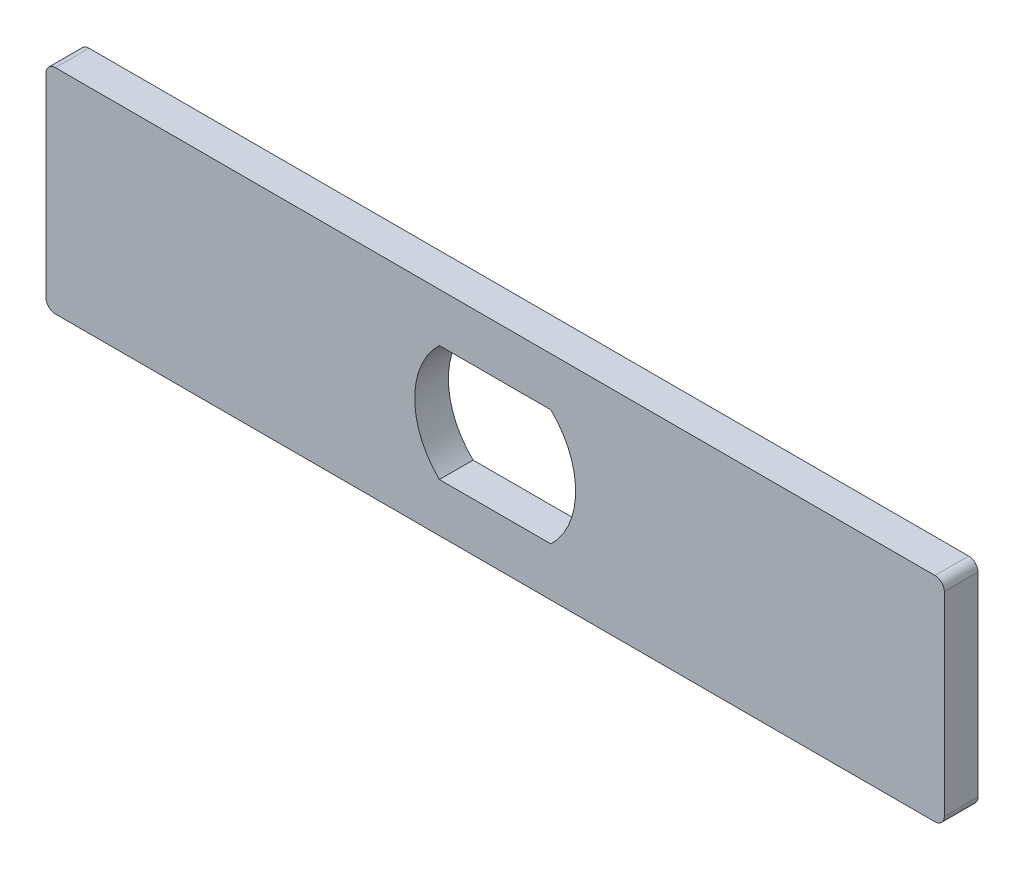
ISO-10303-21;
HEADER;
FILE_DESCRIPTION(('STEP AP214'),'2;1');
FILE_NAME('part.step','',(''),(''),'','','');
FILE_SCHEMA(('AUTOMOTIVE_DESIGN { 1 0 10303 214 1 1 1 1 }'));
ENDSEC;
DATA;
#1=APPLICATION_CONTEXT('core data for automotive mechanical design processes');
#2=APPLICATION_PROTOCOL_DEFINITION('international standard','automotive_design',2000,#1);
#3=PRODUCT_CONTEXT('',#1,'mechanical');
#4=PRODUCT('Part','Part','',(#3));
#5=PRODUCT_RELATED_PRODUCT_CATEGORY('part','',(#4));
#6=PRODUCT_DEFINITION_FORMATION('','',#4);
#7=PRODUCT_DEFINITION_CONTEXT('part definition',#1,'design');
#8=PRODUCT_DEFINITION('design','',#6,#7);
#9=PRODUCT_DEFINITION_SHAPE('','',#8);
#10=(LENGTH_UNIT() NAMED_UNIT(*) SI_UNIT(.MILLI.,.METRE.));
#11=(NAMED_UNIT(*) PLANE_ANGLE_UNIT() SI_UNIT($,.RADIAN.));
#12=(NAMED_UNIT(*) SI_UNIT($,.STERADIAN.) SOLID_ANGLE_UNIT());
#13=UNCERTAINTY_MEASURE_WITH_UNIT(LENGTH_MEASURE(1.E-05),#10,'distance_accuracy_value','');
#14=(GEOMETRIC_REPRESENTATION_CONTEXT(3) GLOBAL_UNCERTAINTY_ASSIGNED_CONTEXT((#13)) GLOBAL_UNIT_ASSIGNED_CONTEXT((#10,
#11,#12)) REPRESENTATION_CONTEXT('',''));
#15=CARTESIAN_POINT('',(0.,0.,0.));
#16=DIRECTION('',(0.,0.,1.));
#17=DIRECTION('',(1.,0.,0.));
#18=AXIS2_PLACEMENT_3D('',#15,#16,#17);
#19=CARTESIAN_POINT('',(60.9011411210408,0.,4.572));
#20=DIRECTION('',(1.,0.,0.));
#21=DIRECTION('',(0.,0.,-1.));
#22=AXIS2_PLACEMENT_3D('',#19,#20,#21);
#23=PLANE('',#22);
#24=DIRECTION('',(0.,-1.,0.));
#25=VECTOR('',#24,1.);
#26=CARTESIAN_POINT('',(60.9011411210408,0.,0.));
#27=LINE('',#26,#25);
#28=CARTESIAN_POINT('',(60.9011411210408,13.2621381013498,0.));
#29=VERTEX_POINT('',#28);
#30=CARTESIAN_POINT('',(60.9011411210408,-13.1538618986502,0.));
#31=VERTEX_POINT('',#30);
#32=EDGE_CURVE('E195',#29,#31,#27,.T.);
#33=ORIENTED_EDGE('',*,*,#32,.F.);
#34=DIRECTION('',(0.,0.,-1.));
#35=VECTOR('',#34,1.);
#36=CARTESIAN_POINT('',(60.9011411210408,13.2621381013498,4.572));
#37=LINE('',#36,#35);
#38=CARTESIAN_POINT('',(60.9011411210408,13.2621381013498,4.572));
#39=VERTEX_POINT('',#38);
#40=EDGE_CURVE('E50',#29,#39,#37,.F.);
#41=ORIENTED_EDGE('',*,*,#40,.T.);
#42=DIRECTION('',(0.,-1.,0.));
#43=VECTOR('',#42,1.);
#44=CARTESIAN_POINT('',(60.9011411210408,0.,4.572));
#45=LINE('',#44,#43);
#46=CARTESIAN_POINT('',(60.9011411210408,-13.1538618986502,4.572));
#47=VERTEX_POINT('',#46);
#48=EDGE_CURVE('E168',#39,#47,#45,.T.);
#49=ORIENTED_EDGE('',*,*,#48,.T.);
#50=DIRECTION('',(0.,0.,-1.));
#51=VECTOR('',#50,1.);
#52=CARTESIAN_POINT('',(60.9011411210408,-13.1538618986502,4.572));
#53=LINE('',#52,#51);
#54=EDGE_CURVE('E237',#47,#31,#53,.T.);
#55=ORIENTED_EDGE('',*,*,#54,.T.);
#56=EDGE_LOOP('',(#33,#41,#49,#55));
#57=FACE_BOUND('',#56,.T.);
#58=ADVANCED_FACE('F41',(#57),#23,.T.);
#59=CARTESIAN_POINT('',(0.,14.5321381013498,4.572));
#60=DIRECTION('',(0.,1.,0.));
#61=DIRECTION('',(0.,0.,1.));
#62=AXIS2_PLACEMENT_3D('',#59,#60,#61);
#63=PLANE('',#62);
#64=DIRECTION('',(1.,0.,0.));
#65=VECTOR('',#64,1.);
#66=CARTESIAN_POINT('',(0.,14.5321381013498,4.572));
#67=LINE('',#66,#65);
#68=CARTESIAN_POINT('',(-59.7488588789592,14.5321381013498,4.572));
#69=VERTEX_POINT('',#68);
#70=CARTESIAN_POINT('',(59.6311411210408,14.5321381013498,4.572));
#71=VERTEX_POINT('',#70);
#72=EDGE_CURVE('E171',#69,#71,#67,.T.);
#73=ORIENTED_EDGE('',*,*,#72,.T.);
#74=DIRECTION('',(0.,0.,-1.));
#75=VECTOR('',#74,1.);
#76=CARTESIAN_POINT('',(59.6311411210408,14.5321381013498,4.572));
#77=LINE('',#76,#75);
#78=CARTESIAN_POINT('',(59.6311411210408,14.5321381013498,0.));
#79=VERTEX_POINT('',#78);
#80=EDGE_CURVE('E251',#71,#79,#77,.T.);
#81=ORIENTED_EDGE('',*,*,#80,.T.);
#82=DIRECTION('',(1.,0.,0.));
#83=VECTOR('',#82,1.);
#84=CARTESIAN_POINT('',(0.,14.5321381013498,0.));
#85=LINE('',#84,#83);
#86=CARTESIAN_POINT('',(-59.7488588789592,14.5321381013498,0.));
#87=VERTEX_POINT('',#86);
#88=EDGE_CURVE('E198',#87,#79,#85,.T.);
#89=ORIENTED_EDGE('',*,*,#88,.F.);
#90=DIRECTION('',(0.,0.,-1.));
#91=VECTOR('',#90,1.);
#92=CARTESIAN_POINT('',(-59.7488588789592,14.5321381013498,4.572));
#93=LINE('',#92,#91);
#94=EDGE_CURVE('E216',#87,#69,#93,.F.);
#95=ORIENTED_EDGE('',*,*,#94,.T.);
#96=EDGE_LOOP('',(#73,#81,#89,#95));
#97=FACE_BOUND('',#96,.T.);
#98=ADVANCED_FACE('F260',(#97),#63,.T.);
#99=CARTESIAN_POINT('',(-61.0188588789592,0.,4.572));
#100=DIRECTION('',(-1.,0.,0.));
#101=DIRECTION('',(0.,0.,1.));
#102=AXIS2_PLACEMENT_3D('',#99,#100,#101);
#103=PLANE('',#102);
#104=DIRECTION('',(0.,1.,0.));
#105=VECTOR('',#104,1.);
#106=CARTESIAN_POINT('',(-61.0188588789592,0.,0.));
#107=LINE('',#106,#105);
#108=CARTESIAN_POINT('',(-61.0188588789592,-13.1538618986502,0.));
#109=VERTEX_POINT('',#108);
#110=CARTESIAN_POINT('',(-61.0188588789592,13.2621381013498,0.));
#111=VERTEX_POINT('',#110);
#112=EDGE_CURVE('E161',#109,#111,#107,.T.);
#113=ORIENTED_EDGE('',*,*,#112,.F.);
#114=DIRECTION('',(0.,0.,-1.));
#115=VECTOR('',#114,1.);
#116=CARTESIAN_POINT('',(-61.0188588789592,-13.1538618986502,4.572));
#117=LINE('',#116,#115);
#118=CARTESIAN_POINT('',(-61.0188588789592,-13.1538618986502,4.572));
#119=VERTEX_POINT('',#118);
#120=EDGE_CURVE('E230',#109,#119,#117,.F.);
#121=ORIENTED_EDGE('',*,*,#120,.T.);
#122=DIRECTION('',(0.,1.,0.));
#123=VECTOR('',#122,1.);
#124=CARTESIAN_POINT('',(-61.0188588789592,0.,4.572));
#125=LINE('',#124,#123);
#126=CARTESIAN_POINT('',(-61.0188588789592,13.2621381013498,4.572));
#127=VERTEX_POINT('',#126);
#128=EDGE_CURVE('E175',#119,#127,#125,.T.);
#129=ORIENTED_EDGE('',*,*,#128,.T.);
#130=DIRECTION('',(0.,0.,-1.));
#131=VECTOR('',#130,1.);
#132=CARTESIAN_POINT('',(-61.0188588789592,13.2621381013498,4.572));
#133=LINE('',#132,#131);
#134=EDGE_CURVE('E141',#127,#111,#133,.T.);
#135=ORIENTED_EDGE('',*,*,#134,.T.);
#136=EDGE_LOOP('',(#113,#121,#129,#135));
#137=FACE_BOUND('',#136,.T.);
#138=ADVANCED_FACE('F273',(#137),#103,.T.);
#139=CARTESIAN_POINT('',(-0.0588588789592198,0.0541381013497624,4.572));
#140=DIRECTION('',(0.,0.,-1.));
#141=DIRECTION('',(-1.,0.,0.));
#142=AXIS2_PLACEMENT_3D('',#139,#140,#141);
#143=CYLINDRICAL_SURFACE('',#142,10.922);
#144=CARTESIAN_POINT('',(-0.0588588789592198,0.0541381013497624,0.));
#145=DIRECTION('',(0.,0.,1.));
#146=DIRECTION('',(1.,0.,0.));
#147=AXIS2_PLACEMENT_3D('',#144,#145,#146);
#148=CIRCLE('',#147,10.922);
#149=CARTESIAN_POINT('',(-7.62563544866768,7.93030317987059,0.));
#150=VERTEX_POINT('',#149);
#151=CARTESIAN_POINT('',(-7.62563544866768,-7.82202697717107,0.));
#152=VERTEX_POINT('',#151);
#153=EDGE_CURVE('E136',#150,#152,#148,.T.);
#154=ORIENTED_EDGE('',*,*,#153,.F.);
#155=DIRECTION('',(0.,0.,-1.));
#156=VECTOR('',#155,1.);
#157=CARTESIAN_POINT('',(-7.62563544866768,7.93030317987059,4.572));
#158=LINE('',#157,#156);
#159=CARTESIAN_POINT('',(-7.62563544866768,7.93030317987059,4.572));
#160=VERTEX_POINT('',#159);
#161=EDGE_CURVE('E129',#160,#150,#158,.T.);
#162=ORIENTED_EDGE('',*,*,#161,.F.);
#163=CARTESIAN_POINT('',(-0.0588588789592198,0.0541381013497624,4.572));
#164=DIRECTION('',(0.,0.,1.));
#165=DIRECTION('',(1.,0.,0.));
#166=AXIS2_PLACEMENT_3D('',#163,#164,#165);
#167=CIRCLE('',#166,10.922);
#168=CARTESIAN_POINT('',(-7.62563544866768,-7.82202697717107,4.572));
#169=VERTEX_POINT('',#168);
#170=EDGE_CURVE('E133',#160,#169,#167,.T.);
#171=ORIENTED_EDGE('',*,*,#170,.T.);
#172=DIRECTION('',(0.,0.,-1.));
#173=VECTOR('',#172,1.);
#174=CARTESIAN_POINT('',(-7.62563544866768,-7.82202697717107,4.572));
#175=LINE('',#174,#173);
#176=EDGE_CURVE('E181',#169,#152,#175,.T.);
#177=ORIENTED_EDGE('',*,*,#176,.T.);
#178=EDGE_LOOP('',(#154,#162,#171,#177));
#179=FACE_BOUND('',#178,.T.);
#180=ADVANCED_FACE('F131',(#179),#143,.F.);
#181=CARTESIAN_POINT('',(0.,7.93030317987059,4.572));
#182=DIRECTION('',(0.,1.,0.));
#183=DIRECTION('',(0.,0.,1.));
#184=AXIS2_PLACEMENT_3D('',#181,#182,#183);
#185=PLANE('',#184);
#186=DIRECTION('',(1.,0.,0.));
#187=VECTOR('',#186,1.);
#188=CARTESIAN_POINT('',(0.,7.93030317987059,0.));
#189=LINE('',#188,#187);
#190=CARTESIAN_POINT('',(7.50791769074924,7.93030317987059,0.));
#191=VERTEX_POINT('',#190);
#192=EDGE_CURVE('E184',#150,#191,#189,.T.);
#193=ORIENTED_EDGE('',*,*,#192,.T.);
#194=DIRECTION('',(0.,0.,-1.));
#195=VECTOR('',#194,1.);
#196=CARTESIAN_POINT('',(7.50791769074924,7.93030317987059,4.572));
#197=LINE('',#196,#195);
#198=CARTESIAN_POINT('',(7.50791769074924,7.93030317987059,4.572));
#199=VERTEX_POINT('',#198);
#200=EDGE_CURVE('E142',#199,#191,#197,.T.);
#201=ORIENTED_EDGE('',*,*,#200,.F.);
#202=DIRECTION('',(1.,0.,0.));
#203=VECTOR('',#202,1.);
#204=CARTESIAN_POINT('',(0.,7.93030317987059,4.572));
#205=LINE('',#204,#203);
#206=EDGE_CURVE('E145',#160,#199,#205,.T.);
#207=ORIENTED_EDGE('',*,*,#206,.F.);
#208=ORIENTED_EDGE('',*,*,#161,.T.);
#209=EDGE_LOOP('',(#193,#201,#207,#208));
#210=FACE_BOUND('',#209,.T.);
#211=ADVANCED_FACE('F146',(#210),#185,.F.);
#212=CARTESIAN_POINT('',(-0.0588588789592198,0.0541381013497624,4.572));
#213=DIRECTION('',(0.,0.,-1.));
#214=DIRECTION('',(-1.,0.,0.));
#215=AXIS2_PLACEMENT_3D('',#212,#213,#214);
#216=CYLINDRICAL_SURFACE('',#215,10.922);
#217=CARTESIAN_POINT('',(-0.0588588789592198,0.0541381013497624,0.));
#218=DIRECTION('',(0.,0.,1.));
#219=DIRECTION('',(1.,0.,0.));
#220=AXIS2_PLACEMENT_3D('',#217,#218,#219);
#221=CIRCLE('',#220,10.922);
#222=CARTESIAN_POINT('',(7.50791769074924,-7.82202697717107,0.));
#223=VERTEX_POINT('',#222);
#224=EDGE_CURVE('E187',#223,#191,#221,.T.);
#225=ORIENTED_EDGE('',*,*,#224,.F.);
#226=DIRECTION('',(0.,0.,-1.));
#227=VECTOR('',#226,1.);
#228=CARTESIAN_POINT('',(7.50791769074924,-7.82202697717107,4.572));
#229=LINE('',#228,#227);
#230=CARTESIAN_POINT('',(7.50791769074924,-7.82202697717107,4.572));
#231=VERTEX_POINT('',#230);
#232=EDGE_CURVE('E205',#231,#223,#229,.T.);
#233=ORIENTED_EDGE('',*,*,#232,.F.);
#234=CARTESIAN_POINT('',(-0.0588588789592198,0.0541381013497624,4.572));
#235=DIRECTION('',(0.,0.,1.));
#236=DIRECTION('',(1.,0.,0.));
#237=AXIS2_PLACEMENT_3D('',#234,#235,#236);
#238=CIRCLE('',#237,10.922);
#239=EDGE_CURVE('E151',#231,#199,#238,.T.);
#240=ORIENTED_EDGE('',*,*,#239,.T.);
#241=ORIENTED_EDGE('',*,*,#200,.T.);
#242=EDGE_LOOP('',(#225,#233,#240,#241));
#243=FACE_BOUND('',#242,.T.);
#244=ADVANCED_FACE('F296',(#243),#216,.F.);
#245=CARTESIAN_POINT('',(0.,-7.82202697717107,4.572));
#246=DIRECTION('',(0.,1.,0.));
#247=DIRECTION('',(0.,0.,1.));
#248=AXIS2_PLACEMENT_3D('',#245,#246,#247);
#249=PLANE('',#248);
#250=DIRECTION('',(1.,0.,0.));
#251=VECTOR('',#250,1.);
#252=CARTESIAN_POINT('',(0.,-7.82202697717107,0.));
#253=LINE('',#252,#251);
#254=EDGE_CURVE('E191',#152,#223,#253,.T.);
#255=ORIENTED_EDGE('',*,*,#254,.F.);
#256=ORIENTED_EDGE('',*,*,#176,.F.);
#257=DIRECTION('',(1.,0.,0.));
#258=VECTOR('',#257,1.);
#259=CARTESIAN_POINT('',(0.,-7.82202697717107,4.572));
#260=LINE('',#259,#258);
#261=EDGE_CURVE('E156',#169,#231,#260,.T.);
#262=ORIENTED_EDGE('',*,*,#261,.T.);
#263=ORIENTED_EDGE('',*,*,#232,.T.);
#264=EDGE_LOOP('',(#255,#256,#262,#263));
#265=FACE_BOUND('',#264,.T.);
#266=ADVANCED_FACE('F292',(#265),#249,.T.);
#267=CARTESIAN_POINT('',(0.,-14.4238618986502,4.572));
#268=DIRECTION('',(0.,-1.,0.));
#269=DIRECTION('',(0.,0.,-1.));
#270=AXIS2_PLACEMENT_3D('',#267,#268,#269);
#271=PLANE('',#270);
#272=DIRECTION('',(-1.,0.,0.));
#273=VECTOR('',#272,1.);
#274=CARTESIAN_POINT('',(0.,-14.4238618986502,0.));
#275=LINE('',#274,#273);
#276=CARTESIAN_POINT('',(59.6311411210408,-14.4238618986502,0.));
#277=VERTEX_POINT('',#276);
#278=CARTESIAN_POINT('',(-59.7488588789592,-14.4238618986502,0.));
#279=VERTEX_POINT('',#278);
#280=EDGE_CURVE('E158',#277,#279,#275,.T.);
#281=ORIENTED_EDGE('',*,*,#280,.F.);
#282=DIRECTION('',(0.,0.,-1.));
#283=VECTOR('',#282,1.);
#284=CARTESIAN_POINT('',(59.6311411210408,-14.4238618986502,4.572));
#285=LINE('',#284,#283);
#286=CARTESIAN_POINT('',(59.6311411210408,-14.4238618986502,4.572));
#287=VERTEX_POINT('',#286);
#288=EDGE_CURVE('E244',#277,#287,#285,.F.);
#289=ORIENTED_EDGE('',*,*,#288,.T.);
#290=DIRECTION('',(-1.,0.,0.));
#291=VECTOR('',#290,1.);
#292=CARTESIAN_POINT('',(0.,-14.4238618986502,4.572));
#293=LINE('',#292,#291);
#294=CARTESIAN_POINT('',(-59.7488588789592,-14.4238618986502,4.572));
#295=VERTEX_POINT('',#294);
#296=EDGE_CURVE('E178',#287,#295,#293,.T.);
#297=ORIENTED_EDGE('',*,*,#296,.T.);
#298=DIRECTION('',(0.,0.,-1.));
#299=VECTOR('',#298,1.);
#300=CARTESIAN_POINT('',(-59.7488588789592,-14.4238618986502,4.572));
#301=LINE('',#300,#299);
#302=EDGE_CURVE('E223',#295,#279,#301,.T.);
#303=ORIENTED_EDGE('',*,*,#302,.T.);
#304=EDGE_LOOP('',(#281,#289,#297,#303));
#305=FACE_BOUND('',#304,.T.);
#306=ADVANCED_FACE('F295',(#305),#271,.T.);
#307=CARTESIAN_POINT('',(0.,0.,4.572));
#308=DIRECTION('',(0.,0.,1.));
#309=DIRECTION('',(1.,0.,0.));
#310=AXIS2_PLACEMENT_3D('',#307,#308,#309);
#311=PLANE('',#310);
#312=ORIENTED_EDGE('',*,*,#170,.F.);
#313=ORIENTED_EDGE('',*,*,#206,.T.);
#314=ORIENTED_EDGE('',*,*,#239,.F.);
#315=ORIENTED_EDGE('',*,*,#261,.F.);
#316=EDGE_LOOP('',(#312,#313,#314,#315));
#317=FACE_BOUND('',#316,.T.);
#318=ORIENTED_EDGE('',*,*,#48,.F.);
#319=CARTESIAN_POINT('',(59.6311411210408,13.2621381013498,4.572));
#320=DIRECTION('',(0.,0.,1.));
#321=DIRECTION('',(1.,0.,0.));
#322=AXIS2_PLACEMENT_3D('',#319,#320,#321);
#323=CIRCLE('',#322,1.27);
#324=EDGE_CURVE('E11',#39,#71,#323,.T.);
#325=ORIENTED_EDGE('',*,*,#324,.T.);
#326=ORIENTED_EDGE('',*,*,#72,.F.);
#327=CARTESIAN_POINT('',(-59.7488588789592,13.2621381013498,4.572));
#328=DIRECTION('',(0.,0.,1.));
#329=DIRECTION('',(1.,0.,0.));
#330=AXIS2_PLACEMENT_3D('',#327,#328,#329);
#331=CIRCLE('',#330,1.27);
#332=EDGE_CURVE('E219',#69,#127,#331,.T.);
#333=ORIENTED_EDGE('',*,*,#332,.T.);
#334=ORIENTED_EDGE('',*,*,#128,.F.);
#335=CARTESIAN_POINT('',(-59.7488588789592,-13.1538618986502,4.572));
#336=DIRECTION('',(0.,0.,1.));
#337=DIRECTION('',(1.,0.,0.));
#338=AXIS2_PLACEMENT_3D('',#335,#336,#337);
#339=CIRCLE('',#338,1.27);
#340=EDGE_CURVE('E233',#119,#295,#339,.T.);
#341=ORIENTED_EDGE('',*,*,#340,.T.);
#342=ORIENTED_EDGE('',*,*,#296,.F.);
#343=CARTESIAN_POINT('',(59.6311411210408,-13.1538618986502,4.572));
#344=DIRECTION('',(0.,0.,1.));
#345=DIRECTION('',(1.,0.,0.));
#346=AXIS2_PLACEMENT_3D('',#343,#344,#345);
#347=CIRCLE('',#346,1.27);
#348=EDGE_CURVE('E247',#287,#47,#347,.T.);
#349=ORIENTED_EDGE('',*,*,#348,.T.);
#350=EDGE_LOOP('',(#318,#325,#326,#333,#334,#341,#342,#349));
#351=FACE_BOUND('',#350,.T.);
#352=ADVANCED_FACE('F153',(#317,#351),#311,.T.);
#353=CARTESIAN_POINT('',(0.,0.,0.));
#354=DIRECTION('',(0.,0.,1.));
#355=DIRECTION('',(1.,0.,0.));
#356=AXIS2_PLACEMENT_3D('',#353,#354,#355);
#357=PLANE('',#356);
#358=ORIENTED_EDGE('',*,*,#153,.T.);
#359=ORIENTED_EDGE('',*,*,#254,.T.);
#360=ORIENTED_EDGE('',*,*,#224,.T.);
#361=ORIENTED_EDGE('',*,*,#192,.F.);
#362=EDGE_LOOP('',(#358,#359,#360,#361));
#363=FACE_BOUND('',#362,.T.);
#364=ORIENTED_EDGE('',*,*,#88,.T.);
#365=CARTESIAN_POINT('',(59.6311411210408,13.2621381013498,0.));
#366=DIRECTION('',(0.,0.,1.));
#367=DIRECTION('',(1.,0.,0.));
#368=AXIS2_PLACEMENT_3D('',#365,#366,#367);
#369=CIRCLE('',#368,1.27);
#370=EDGE_CURVE('E64',#79,#29,#369,.F.);
#371=ORIENTED_EDGE('',*,*,#370,.T.);
#372=ORIENTED_EDGE('',*,*,#32,.T.);
#373=CARTESIAN_POINT('',(59.6311411210408,-13.1538618986502,0.));
#374=DIRECTION('',(0.,0.,1.));
#375=DIRECTION('',(1.,0.,0.));
#376=AXIS2_PLACEMENT_3D('',#373,#374,#375);
#377=CIRCLE('',#376,1.27);
#378=EDGE_CURVE('E241',#31,#277,#377,.F.);
#379=ORIENTED_EDGE('',*,*,#378,.T.);
#380=ORIENTED_EDGE('',*,*,#280,.T.);
#381=CARTESIAN_POINT('',(-59.7488588789592,-13.1538618986502,0.));
#382=DIRECTION('',(0.,0.,1.));
#383=DIRECTION('',(1.,0.,0.));
#384=AXIS2_PLACEMENT_3D('',#381,#382,#383);
#385=CIRCLE('',#384,1.27);
#386=EDGE_CURVE('E227',#279,#109,#385,.F.);
#387=ORIENTED_EDGE('',*,*,#386,.T.);
#388=ORIENTED_EDGE('',*,*,#112,.T.);
#389=CARTESIAN_POINT('',(-59.7488588789592,13.2621381013498,0.));
#390=DIRECTION('',(0.,0.,1.));
#391=DIRECTION('',(1.,0.,0.));
#392=AXIS2_PLACEMENT_3D('',#389,#390,#391);
#393=CIRCLE('',#392,1.27);
#394=EDGE_CURVE('E213',#111,#87,#393,.F.);
#395=ORIENTED_EDGE('',*,*,#394,.T.);
#396=EDGE_LOOP('',(#364,#371,#372,#379,#380,#387,#388,#395));
#397=FACE_BOUND('',#396,.T.);
#398=ADVANCED_FACE('F265',(#363,#397),#357,.F.);
#399=CARTESIAN_POINT('',(-59.7488588789592,13.2621381013498,4.572));
#400=DIRECTION('',(0.,0.,-1.));
#401=DIRECTION('',(-1.,0.,0.));
#402=AXIS2_PLACEMENT_3D('',#399,#400,#401);
#403=CYLINDRICAL_SURFACE('',#402,1.27);
#404=ORIENTED_EDGE('',*,*,#332,.F.);
#405=ORIENTED_EDGE('',*,*,#94,.F.);
#406=ORIENTED_EDGE('',*,*,#394,.F.);
#407=ORIENTED_EDGE('',*,*,#134,.F.);
#408=EDGE_LOOP('',(#404,#405,#406,#407));
#409=FACE_BOUND('',#408,.T.);
#410=ADVANCED_FACE('F271',(#409),#403,.T.);
#411=CARTESIAN_POINT('',(-59.7488588789592,-13.1538618986502,4.572));
#412=DIRECTION('',(0.,0.,-1.));
#413=DIRECTION('',(-1.,0.,0.));
#414=AXIS2_PLACEMENT_3D('',#411,#412,#413);
#415=CYLINDRICAL_SURFACE('',#414,1.27);
#416=ORIENTED_EDGE('',*,*,#340,.F.);
#417=ORIENTED_EDGE('',*,*,#120,.F.);
#418=ORIENTED_EDGE('',*,*,#386,.F.);
#419=ORIENTED_EDGE('',*,*,#302,.F.);
#420=EDGE_LOOP('',(#416,#417,#418,#419));
#421=FACE_BOUND('',#420,.T.);
#422=ADVANCED_FACE('F282',(#421),#415,.T.);
#423=CARTESIAN_POINT('',(59.6311411210408,-13.1538618986502,4.572));
#424=DIRECTION('',(0.,0.,-1.));
#425=DIRECTION('',(-1.,0.,0.));
#426=AXIS2_PLACEMENT_3D('',#423,#424,#425);
#427=CYLINDRICAL_SURFACE('',#426,1.27);
#428=ORIENTED_EDGE('',*,*,#348,.F.);
#429=ORIENTED_EDGE('',*,*,#288,.F.);
#430=ORIENTED_EDGE('',*,*,#378,.F.);
#431=ORIENTED_EDGE('',*,*,#54,.F.);
#432=EDGE_LOOP('',(#428,#429,#430,#431));
#433=FACE_BOUND('',#432,.T.);
#434=ADVANCED_FACE('F278',(#433),#427,.T.);
#435=CARTESIAN_POINT('',(59.6311411210408,13.2621381013498,4.572));
#436=DIRECTION('',(0.,0.,-1.));
#437=DIRECTION('',(-1.,0.,0.));
#438=AXIS2_PLACEMENT_3D('',#435,#436,#437);
#439=CYLINDRICAL_SURFACE('',#438,1.27);
#440=ORIENTED_EDGE('',*,*,#324,.F.);
#441=ORIENTED_EDGE('',*,*,#40,.F.);
#442=ORIENTED_EDGE('',*,*,#370,.F.);
#443=ORIENTED_EDGE('',*,*,#80,.F.);
#444=EDGE_LOOP('',(#440,#441,#442,#443));
#445=FACE_BOUND('',#444,.T.);
#446=ADVANCED_FACE('F43',(#445),#439,.T.);
#447=CLOSED_SHELL('',(#58,#98,#138,#180,#211,#244,#266,#306,#352,#398,#410,#422,#434,#446));
#448=MANIFOLD_SOLID_BREP('B2',#447);
#449=ADVANCED_BREP_SHAPE_REPRESENTATION('',(#18,#448),#14);
#450=SHAPE_DEFINITION_REPRESENTATION(#9,#449);
ENDSEC;
END-ISO-10303-21;
